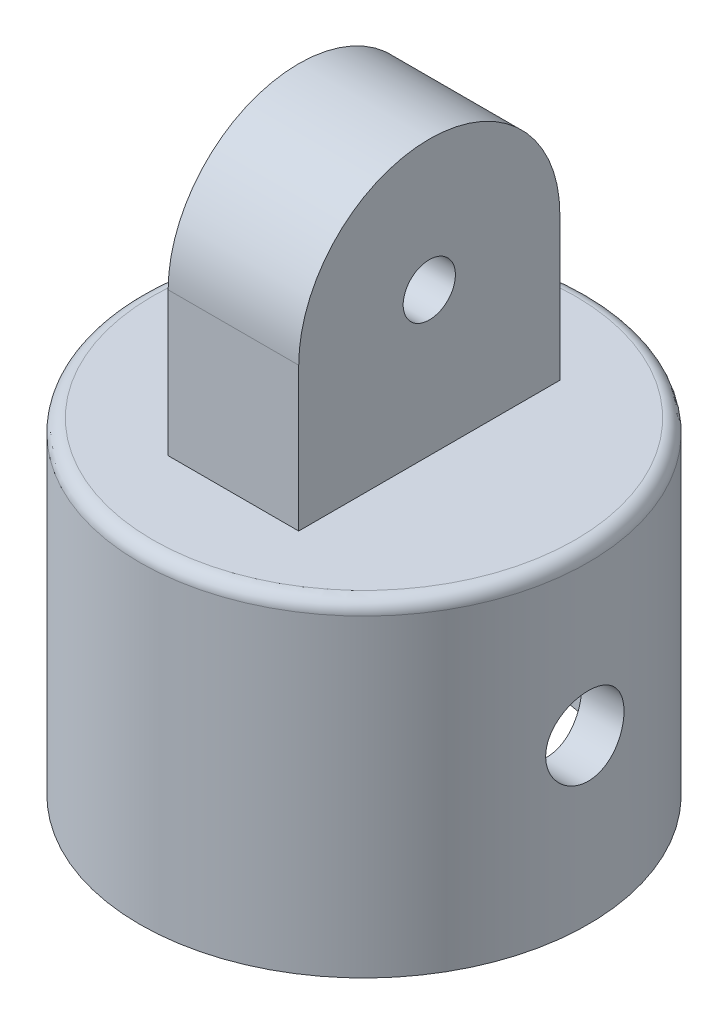
ISO-10303-21;
HEADER;
FILE_DESCRIPTION(('STEP AP214'),'2;1');
FILE_NAME('part.step','',(''),(''),'','','');
FILE_SCHEMA(('AUTOMOTIVE_DESIGN { 1 0 10303 214 1 1 1 1 }'));
ENDSEC;
DATA;
#1=APPLICATION_CONTEXT('core data for automotive mechanical design processes');
#2=APPLICATION_PROTOCOL_DEFINITION('international standard','automotive_design',2000,#1);
#3=PRODUCT_CONTEXT('',#1,'mechanical');
#4=PRODUCT('Part','Part','',(#3));
#5=PRODUCT_RELATED_PRODUCT_CATEGORY('part','',(#4));
#6=PRODUCT_DEFINITION_FORMATION('','',#4);
#7=PRODUCT_DEFINITION_CONTEXT('part definition',#1,'design');
#8=PRODUCT_DEFINITION('design','',#6,#7);
#9=PRODUCT_DEFINITION_SHAPE('','',#8);
#10=(LENGTH_UNIT() NAMED_UNIT(*) SI_UNIT(.MILLI.,.METRE.));
#11=(NAMED_UNIT(*) PLANE_ANGLE_UNIT() SI_UNIT($,.RADIAN.));
#12=(NAMED_UNIT(*) SI_UNIT($,.STERADIAN.) SOLID_ANGLE_UNIT());
#13=UNCERTAINTY_MEASURE_WITH_UNIT(LENGTH_MEASURE(1.E-05),#10,'distance_accuracy_value','');
#14=(GEOMETRIC_REPRESENTATION_CONTEXT(3) GLOBAL_UNCERTAINTY_ASSIGNED_CONTEXT((#13)) GLOBAL_UNIT_ASSIGNED_CONTEXT((#10,
#11,#12)) REPRESENTATION_CONTEXT('',''));
#15=CARTESIAN_POINT('',(0.,0.,0.));
#16=DIRECTION('',(0.,0.,1.));
#17=DIRECTION('',(1.,0.,0.));
#18=AXIS2_PLACEMENT_3D('',#15,#16,#17);
#19=CARTESIAN_POINT('',(0.,25.,0.));
#20=DIRECTION('',(0.,1.,0.));
#21=DIRECTION('',(0.,0.,1.));
#22=AXIS2_PLACEMENT_3D('',#19,#20,#21);
#23=PLANE('',#22);
#24=CARTESIAN_POINT('',(0.,25.,0.));
#25=DIRECTION('',(0.,1.,0.));
#26=DIRECTION('',(0.,0.,1.));
#27=AXIS2_PLACEMENT_3D('',#24,#25,#26);
#28=CIRCLE('',#27,16.175);
#29=CARTESIAN_POINT('',(0.,25.,16.175));
#30=VERTEX_POINT('',#29);
#31=EDGE_CURVE('E45',#30,#30,#28,.T.);
#32=ORIENTED_EDGE('',*,*,#31,.T.);
#33=EDGE_LOOP('',(#32));
#34=FACE_BOUND('',#33,.T.);
#35=DIRECTION('',(0.,0.,-1.));
#36=VECTOR('',#35,1.);
#37=CARTESIAN_POINT('',(5.,25.,0.));
#38=LINE('',#37,#36);
#39=CARTESIAN_POINT('',(5.,25.,10.));
#40=VERTEX_POINT('',#39);
#41=CARTESIAN_POINT('',(5.,25.,-10.));
#42=VERTEX_POINT('',#41);
#43=EDGE_CURVE('E152',#40,#42,#38,.T.);
#44=ORIENTED_EDGE('',*,*,#43,.F.);
#45=DIRECTION('',(-1.,0.,0.));
#46=VECTOR('',#45,1.);
#47=CARTESIAN_POINT('',(0.,25.,10.));
#48=LINE('',#47,#46);
#49=CARTESIAN_POINT('',(-5.,25.,10.));
#50=VERTEX_POINT('',#49);
#51=EDGE_CURVE('E60',#40,#50,#48,.T.);
#52=ORIENTED_EDGE('',*,*,#51,.T.);
#53=DIRECTION('',(0.,0.,-1.));
#54=VECTOR('',#53,1.);
#55=CARTESIAN_POINT('',(-5.,25.,0.));
#56=LINE('',#55,#54);
#57=CARTESIAN_POINT('',(-5.,25.,-10.));
#58=VERTEX_POINT('',#57);
#59=EDGE_CURVE('E148',#50,#58,#56,.T.);
#60=ORIENTED_EDGE('',*,*,#59,.T.);
#61=DIRECTION('',(1.,0.,0.));
#62=VECTOR('',#61,1.);
#63=CARTESIAN_POINT('',(0.,25.,-10.));
#64=LINE('',#63,#62);
#65=EDGE_CURVE('E145',#58,#42,#64,.T.);
#66=ORIENTED_EDGE('',*,*,#65,.T.);
#67=EDGE_LOOP('',(#44,#52,#60,#66));
#68=FACE_BOUND('',#67,.T.);
#69=ADVANCED_FACE('F37',(#34,#68),#23,.T.);
#70=CARTESIAN_POINT('',(0.,25.,0.));
#71=DIRECTION('',(0.,-1.,0.));
#72=DIRECTION('',(0.,0.,-1.));
#73=AXIS2_PLACEMENT_3D('',#70,#71,#72);
#74=CYLINDRICAL_SURFACE('',#73,17.175);
#75=CARTESIAN_POINT('',(0.,24.,0.));
#76=DIRECTION('',(0.,1.,0.));
#77=DIRECTION('',(0.,0.,1.));
#78=AXIS2_PLACEMENT_3D('',#75,#76,#77);
#79=CIRCLE('',#78,17.175);
#80=CARTESIAN_POINT('',(0.,24.,17.175));
#81=VERTEX_POINT('',#80);
#82=EDGE_CURVE('E11',#81,#81,#79,.F.);
#83=ORIENTED_EDGE('',*,*,#82,.T.);
#84=EDGE_LOOP('',(#83));
#85=FACE_BOUND('',#84,.T.);
#86=CARTESIAN_POINT('',(-17.175,9.5,0.));
#87=CARTESIAN_POINT('',(-17.1749970635052,9.50000659187211,-0.167148289489279));
#88=CARTESIAN_POINT('',(-17.1725346177836,9.51401647281769,-0.334384800368738));
#89=CARTESIAN_POINT('',(-17.1629486341287,9.56965780189534,-0.664159130061681));
#90=CARTESIAN_POINT('',(-17.1558209407032,9.61131387587927,-0.826692624838318));
#91=CARTESIAN_POINT('',(-17.1377031338341,9.72094464458748,-1.14224276081582));
#92=CARTESIAN_POINT('',(-17.1267163032768,9.78889697462577,-1.29526736122225));
#93=CARTESIAN_POINT('',(-17.1020851745473,9.94913090339013,-1.58772576854048));
#94=CARTESIAN_POINT('',(-17.0884411471491,10.0414100235033,-1.72716095807158));
#95=CARTESIAN_POINT('',(-17.0598461682079,10.2487038894629,-1.98995828223652));
#96=CARTESIAN_POINT('',(-17.0448841752576,10.3639234350489,-2.11315768711522));
#97=CARTESIAN_POINT('',(-17.0154231251547,10.6133867465183,-2.33857979672025));
#98=CARTESIAN_POINT('',(-17.0009240987208,10.7476317715845,-2.44080111193502));
#99=CARTESIAN_POINT('',(-16.9739235816364,11.0324652249675,-2.62202674431745));
#100=CARTESIAN_POINT('',(-16.9614363483647,11.1831586054149,-2.70086841769337));
#101=CARTESIAN_POINT('',(-16.9400274037381,11.495905269024,-2.83205626116239));
#102=CARTESIAN_POINT('',(-16.9311054270846,11.6579577058787,-2.88440440277363));
#103=CARTESIAN_POINT('',(-16.9179475782782,11.9870912059426,-2.96060290992415));
#104=CARTESIAN_POINT('',(-16.9136653614662,12.1541050869472,-2.98473530704476));
#105=CARTESIAN_POINT('',(-16.9101318739057,12.4898621363561,-3.00469209986036));
#106=CARTESIAN_POINT('',(-16.9108802120575,12.6586051693094,-3.00051869618475));
#107=CARTESIAN_POINT('',(-16.9172810108101,12.9910061934551,-2.96421169390425));
#108=CARTESIAN_POINT('',(-16.9228776493146,13.1547001782352,-2.93239634545114));
#109=CARTESIAN_POINT('',(-16.9382569593342,13.474390653706,-2.84220866801327));
#110=CARTESIAN_POINT('',(-16.9480397872363,13.6303868565815,-2.78383534687561));
#111=CARTESIAN_POINT('',(-16.9707487790121,13.9311983397534,-2.64187032723561));
#112=CARTESIAN_POINT('',(-16.9836911768204,14.0759506160922,-2.55814783258912));
#113=CARTESIAN_POINT('',(-17.0112499621668,14.3494724281278,-2.3679537669558));
#114=CARTESIAN_POINT('',(-17.0258664977133,14.4782405485844,-2.26148018385122));
#115=CARTESIAN_POINT('',(-17.0553711743625,14.7179797338008,-2.02707906331825));
#116=CARTESIAN_POINT('',(-17.0702603012824,14.8286841763528,-1.89887877895758));
#117=CARTESIAN_POINT('',(-17.0984487009776,15.027052108912,-1.62558219088861));
#118=CARTESIAN_POINT('',(-17.1117479615503,15.1147154220809,-1.48048575751645));
#119=CARTESIAN_POINT('',(-17.1352798688426,15.264542451419,-1.17725477739282));
#120=CARTESIAN_POINT('',(-17.1455094943506,15.3266810675832,-1.01910757962066));
#121=CARTESIAN_POINT('',(-17.1617256495258,15.4234392102041,-0.694402499751714));
#122=CARTESIAN_POINT('',(-17.1677125695406,15.458061268342,-0.527845392914766));
#123=CARTESIAN_POINT('',(-17.1747158434113,15.4984384811538,-0.193344907664775));
#124=CARTESIAN_POINT('',(-17.1757951716153,15.5045593880773,-0.0254469524642002));
#125=CARTESIAN_POINT('',(-17.1730346789395,15.4887378765646,0.308974548671828));
#126=CARTESIAN_POINT('',(-17.1691950666511,15.4667966481246,0.475498152586318));
#127=CARTESIAN_POINT('',(-17.1570671809606,15.3957778850986,0.801302943557366));
#128=CARTESIAN_POINT('',(-17.1488088469861,15.3468829112129,0.960625136164098));
#129=CARTESIAN_POINT('',(-17.1287656717313,15.223540311392,1.2688109184486));
#130=CARTESIAN_POINT('',(-17.1169806165634,15.1490911356122,1.41767387312109));
#131=CARTESIAN_POINT('',(-17.0910345716264,14.975926259707,1.70229395561455));
#132=CARTESIAN_POINT('',(-17.0768518092164,14.8769839333216,1.83791117848541));
#133=CARTESIAN_POINT('',(-17.0477454304149,14.6579512098598,2.09074803908737));
#134=CARTESIAN_POINT('',(-17.0328217546295,14.5378591153785,2.20796619874628));
#135=CARTESIAN_POINT('',(-17.0037099310466,14.278289539754,2.42204600586923));
#136=CARTESIAN_POINT('',(-16.9895321436978,14.138606116474,2.51865958610338));
#137=CARTESIAN_POINT('',(-16.9637162708469,13.8447775118953,2.68705094428561));
#138=CARTESIAN_POINT('',(-16.9520780993174,13.690632820713,2.75882956354568));
#139=CARTESIAN_POINT('',(-16.9327382512476,13.3729271733318,2.87514955803787));
#140=CARTESIAN_POINT('',(-16.9250192797085,13.2094111946521,2.91981077354952));
#141=CARTESIAN_POINT('',(-16.9143498078558,12.8770510328357,2.98100271523357));
#142=CARTESIAN_POINT('',(-16.9113988478569,12.7082073649434,2.99753615322143));
#143=CARTESIAN_POINT('',(-16.9106206478166,12.3724645111295,3.00192193428798));
#144=CARTESIAN_POINT('',(-16.9127236017402,12.2055704639702,2.99016502846423));
#145=CARTESIAN_POINT('',(-16.9216626242146,11.8761750903346,2.93915270403888));
#146=CARTESIAN_POINT('',(-16.9284986729106,11.7136737454344,2.89989740079008));
#147=CARTESIAN_POINT('',(-16.9461060307579,11.3978496719317,2.79515801956038));
#148=CARTESIAN_POINT('',(-16.9568718055419,11.2445143861714,2.72971081609416));
#149=CARTESIAN_POINT('',(-16.9811303642995,10.95093729936,2.57448646081305));
#150=CARTESIAN_POINT('',(-16.9946233051323,10.8106962521326,2.4847079094235));
#151=CARTESIAN_POINT('',(-17.0230354940364,10.5453205092101,2.28198809707014));
#152=CARTESIAN_POINT('',(-17.0379710253367,10.4204062725833,2.16876047619869));
#153=CARTESIAN_POINT('',(-17.067458706083,10.1912184950816,1.92295833387837));
#154=CARTESIAN_POINT('',(-17.082010766475,10.0869497127433,1.79037936437327));
#155=CARTESIAN_POINT('',(-17.1092217915965,9.90127568070745,1.50842603254887));
#156=CARTESIAN_POINT('',(-17.1218653924572,9.82005178664257,1.35893073454188));
#157=CARTESIAN_POINT('',(-17.1436853894143,9.68399786129939,1.0482522273996));
#158=CARTESIAN_POINT('',(-17.1528651644407,9.6291420937722,0.887080592369371));
#159=CARTESIAN_POINT('',(-17.1647684386511,9.55900518072146,0.604447490662792));
#160=CARTESIAN_POINT('',(-17.1685843403967,9.53691454338781,0.484675630115192));
#161=CARTESIAN_POINT('',(-17.1737011645946,9.50740970100603,0.243284735642671));
#162=CARTESIAN_POINT('',(-17.1750021374482,9.49999520183549,0.121665738785172));
#163=CARTESIAN_POINT('',(-17.175,9.5,0.));
#164=B_SPLINE_CURVE_WITH_KNOTS('',3,(#86,#87,#88,#89,#90,#91,#92,#93,#94,#95,#96,#97,#98,#99,
#100,#101,#102,#103,#104,#105,#106,#107,#108,#109,#110,#111,#112,#113,#114,#115,#116,#117,#118,
#119,#120,#121,#122,#123,#124,#125,#126,#127,#128,#129,#130,#131,#132,#133,#134,#135,#136,#137,
#138,#139,#140,#141,#142,#143,#144,#145,#146,#147,#148,#149,#150,#151,#152,#153,#154,#155,#156,
#157,#158,#159,#160,#161,#162,#163),.UNSPECIFIED.,.T.,.F.,(4,2,2,2,2,2,2,2,2,2,2,2,2,2,2,2,2,2,
2,2,2,2,2,2,2,2,2,2,2,2,2,2,2,2,2,2,2,2,4),(0.,0.501000066437476,1.00244699881175,
1.50346838988534,2.00443875250745,2.51010007732385,3.01579488448559,3.52492926900674,
4.03402576068198,4.53798883619437,5.04191273163709,5.54011054710815,6.03832697578471,
6.53915921439406,7.04003576520604,7.54774222983647,8.055452590948,8.56366102653766,
9.07182269862152,9.57344487686842,10.0750457841498,10.5732903082599,11.0715650558912,
11.5746347810325,12.0777448991671,12.5866072768891,13.0954524146425,13.6020321213631,
14.1085629856701,14.6081378096685,15.1077105380169,15.606582398579,16.1054829610717,
16.6108792262553,17.1163918441329,17.6257788159822,18.1346675929965,18.4993483505383,
18.8640217994906),.UNSPECIFIED.);
#165=CARTESIAN_POINT('',(-17.175,9.5,0.));
#166=VERTEX_POINT('',#165);
#167=EDGE_CURVE('E113',#166,#166,#164,.T.);
#168=ORIENTED_EDGE('',*,*,#167,.T.);
#169=EDGE_LOOP('',(#168));
#170=FACE_BOUND('',#169,.T.);
#171=CARTESIAN_POINT('',(16.9109616817022,12.5,-3.));
#172=CARTESIAN_POINT('',(16.9109647913376,12.332873637246,-2.99999339013559));
#173=CARTESIAN_POINT('',(16.9134660473036,12.1656590005569,-2.9859870604747));
#174=CARTESIAN_POINT('',(16.9231904689292,11.8359301012465,-2.9303611162025));
#175=CARTESIAN_POINT('',(16.9304178595155,11.6734201802731,-2.88871679412004));
#176=CARTESIAN_POINT('',(16.9487515769502,11.3579199450822,-2.77912038868063));
#177=CARTESIAN_POINT('',(16.959854523746,11.2049214720295,-2.71119122397177));
#178=CARTESIAN_POINT('',(16.9846843365821,10.9125070319998,-2.55101188588846));
#179=CARTESIAN_POINT('',(16.9984109410671,10.773089713192,-2.45876413651376));
#180=CARTESIAN_POINT('',(17.0271072860652,10.5102729942818,-2.25150228897949));
#181=CARTESIAN_POINT('',(17.0420877786174,10.3870418013502,-2.13627635554347));
#182=CARTESIAN_POINT('',(17.0715086707297,10.1615581158525,-1.88678681859762));
#183=CARTESIAN_POINT('',(17.0859490369867,10.0593069151305,-1.75252204363051));
#184=CARTESIAN_POINT('',(17.1127769682926,9.87804939847534,-1.46767050891587));
#185=CARTESIAN_POINT('',(17.1251504054511,9.79920040883237,-1.3169821945645));
#186=CARTESIAN_POINT('',(17.1463304103324,9.66799765211117,-1.00424651108797));
#187=CARTESIAN_POINT('',(17.1551372326046,9.61564199413577,-0.84219995356997));
#188=CARTESIAN_POINT('',(17.1681157975394,9.53942870950504,-0.513087644709646));
#189=CARTESIAN_POINT('',(17.1723335391822,9.5152880821777,-0.346089272188525));
#190=CARTESIAN_POINT('',(17.1758169482093,9.49530945151501,-0.0103628244628817));
#191=CARTESIAN_POINT('',(17.1750829837833,9.49946934386272,0.158365121205772));
#192=CARTESIAN_POINT('',(17.168781918279,9.53575432433687,0.490824036666636));
#193=CARTESIAN_POINT('',(17.1632674655701,9.56757479201192,0.654589394185489));
#194=CARTESIAN_POINT('',(17.1480838423594,9.65779720508036,0.974419945331944));
#195=CARTESIAN_POINT('',(17.1384145357717,9.71620002114152,1.13048488655755));
#196=CARTESIAN_POINT('',(17.115918595028,9.8582273700751,1.43138212205215));
#197=CARTESIAN_POINT('',(17.1030764809756,9.94197602815822,1.57615462310757));
#198=CARTESIAN_POINT('',(17.0756592996357,10.1322266203138,1.84970591880123));
#199=CARTESIAN_POINT('',(17.0610840787271,10.238730572062,1.97848329357472));
#200=CARTESIAN_POINT('',(17.0315900894273,10.4731540541142,2.21819055470915));
#201=CARTESIAN_POINT('',(17.0166693309355,10.6013399359537,2.32885987344869));
#202=CARTESIAN_POINT('',(16.988352874681,10.8745949135443,2.52716368652488));
#203=CARTESIAN_POINT('',(16.974957193806,11.0196641962163,2.6147979257988));
#204=CARTESIAN_POINT('',(16.9512058457777,11.3228861726497,2.76460366713648));
#205=CARTESIAN_POINT('',(16.940854215749,11.4810558877342,2.826741397623));
#206=CARTESIAN_POINT('',(16.9244278299057,11.8058101489868,2.92349094769237));
#207=CARTESIAN_POINT('',(16.9183526579099,11.972393874619,2.95810544585527));
#208=CARTESIAN_POINT('',(16.9112482701092,12.3069092968287,2.99845404557244));
#209=CARTESIAN_POINT('',(16.9101539726438,12.4747947216053,3.00456066717762));
#210=CARTESIAN_POINT('',(16.9129615867985,12.809187796133,2.98871505898387));
#211=CARTESIAN_POINT('',(16.9168632855497,12.9756955042815,2.96676402466303));
#212=CARTESIAN_POINT('',(16.9291629562577,13.3014079941883,2.89574465118159));
#213=CARTESIAN_POINT('',(16.9375291275207,13.4606558855417,2.84686802589495));
#214=CARTESIAN_POINT('',(16.9577881407255,13.7687011257263,2.72358683137779));
#215=CARTESIAN_POINT('',(16.9696812120987,13.9174977939068,2.64918060134963));
#216=CARTESIAN_POINT('',(16.9958040823137,14.202068504816,2.47608123690537));
#217=CARTESIAN_POINT('',(17.0100562464217,14.3376960120342,2.37715063911283));
#218=CARTESIAN_POINT('',(17.0392269725185,14.5905590351304,2.15813460936459));
#219=CARTESIAN_POINT('',(17.0541455861187,14.7077931233953,2.03804753687423));
#220=CARTESIAN_POINT('',(17.0831753451256,14.9219134010532,1.77847196406111));
#221=CARTESIAN_POINT('',(17.0972752459255,15.0185503711124,1.63877643516675));
#222=CARTESIAN_POINT('',(17.1228953366057,15.1869827127351,1.34491679859698));
#223=CARTESIAN_POINT('',(17.1344156160993,15.2587789472877,1.1907531937919));
#224=CARTESIAN_POINT('',(17.1535297592583,15.375109403661,0.873054625337926));
#225=CARTESIAN_POINT('',(17.1611419487938,15.4197710497435,0.709567470398412));
#226=CARTESIAN_POINT('',(17.1716599669864,15.4809735967883,0.377268587830866));
#227=CARTESIAN_POINT('',(17.1745662227179,15.4975170495482,0.208457344793764));
#228=CARTESIAN_POINT('',(17.1753379699681,15.5019344376074,-0.127298170002415));
#229=CARTESIAN_POINT('',(17.1732699476744,15.4901865128768,-0.294237433586659));
#230=CARTESIAN_POINT('',(17.1644621244481,15.439176341245,-0.623725607157988));
#231=CARTESIAN_POINT('',(17.1577223561877,15.3999142867662,-0.786274547840916));
#232=CARTESIAN_POINT('',(17.1403264689128,15.2951408723118,-1.10220282165255));
#233=CARTESIAN_POINT('',(17.1296756003481,15.2296646928521,-1.25559412895426));
#234=CARTESIAN_POINT('',(17.1056165660197,15.0743648795257,-1.54927133945047));
#235=CARTESIAN_POINT('',(17.0922082490608,14.9845399104895,-1.68955652340127));
#236=CARTESIAN_POINT('',(17.0639064596208,14.7817660893504,-1.95493678018361));
#237=CARTESIAN_POINT('',(17.0489964865861,14.668541658029,-2.0798195501813));
#238=CARTESIAN_POINT('',(17.0194822427417,14.4227592248074,-2.30894532011218));
#239=CARTESIAN_POINT('',(17.004878044398,14.2901966979482,-2.41318347587564));
#240=CARTESIAN_POINT('',(16.9775043415702,14.0082595324615,-2.59882094741004));
#241=CARTESIAN_POINT('',(16.9647501623204,13.8587609238927,-2.68003428284642));
#242=CARTESIAN_POINT('',(16.9427027685316,13.5480760934511,-2.81606757729606));
#243=CARTESIAN_POINT('',(16.9334061687136,13.386901489181,-2.8709133679717));
#244=CARTESIAN_POINT('',(16.9213429419486,13.1042943851081,-2.94102489719931));
#245=CARTESIAN_POINT('',(16.9174721531613,12.9845532008565,-2.96310419623825));
#246=CARTESIAN_POINT('',(16.9122804185297,12.7432235710392,-2.99259399711576));
#247=CARTESIAN_POINT('',(16.9109594184984,12.6216351647852,-3.00000481068297));
#248=CARTESIAN_POINT('',(16.9109616817022,12.5,-3.));
#249=B_SPLINE_CURVE_WITH_KNOTS('',3,(#171,#172,#173,#174,#175,#176,#177,#178,#179,#180,#181,
#182,#183,#184,#185,#186,#187,#188,#189,#190,#191,#192,#193,#194,#195,#196,#197,#198,#199,#200,
#201,#202,#203,#204,#205,#206,#207,#208,#209,#210,#211,#212,#213,#214,#215,#216,#217,#218,#219,
#220,#221,#222,#223,#224,#225,#226,#227,#228,#229,#230,#231,#232,#233,#234,#235,#236,#237,#238,
#239,#240,#241,#242,#243,#244,#245,#246,#247,#248),.UNSPECIFIED.,.T.,.F.,(4,2,2,2,2,2,2,2,2,2,2,
2,2,2,2,2,2,2,2,2,2,2,2,2,2,2,2,2,2,2,2,2,2,2,2,2,2,2,4),(0.,0.500934172760822,1.00231676877236,
1.50326317380056,2.00415966493992,2.5099072420403,3.01568595123279,3.52479161148077,
4.03386093042255,4.53777916233192,5.04165992524419,5.54006085958786,6.03847811953435,
6.53937687996212,7.04032007273519,7.54793561894886,8.0555567856488,8.56384817172662,
9.07209008447787,9.57367171983823,10.0752319845657,10.5732663833901,11.0713331873862,
11.574425128435,12.0775560978825,12.5864668350835,13.0953598904999,13.6018443266812,
14.1082827956589,14.6079899070335,15.1076935236985,15.6067287520094,16.1057913505316,
16.6111057584429,17.1165385960886,17.6259446987382,18.1348507260995,18.4994401575494,
18.8640218408112),.UNSPECIFIED.);
#250=CARTESIAN_POINT('',(16.9109616817022,12.5,-3.));
#251=VERTEX_POINT('',#250);
#252=EDGE_CURVE('E106',#251,#251,#249,.T.);
#253=ORIENTED_EDGE('',*,*,#252,.T.);
#254=EDGE_LOOP('',(#253));
#255=FACE_BOUND('',#254,.T.);
#256=CARTESIAN_POINT('',(0.,0.,0.));
#257=DIRECTION('',(0.,1.,0.));
#258=DIRECTION('',(0.,0.,1.));
#259=AXIS2_PLACEMENT_3D('',#256,#257,#258);
#260=CIRCLE('',#259,17.175);
#261=CARTESIAN_POINT('',(0.,0.,17.175));
#262=VERTEX_POINT('',#261);
#263=EDGE_CURVE('E149',#262,#262,#260,.T.);
#264=ORIENTED_EDGE('',*,*,#263,.T.);
#265=EDGE_LOOP('',(#264));
#266=FACE_BOUND('',#265,.T.);
#267=ADVANCED_FACE('F118',(#85,#170,#255,#266),#74,.T.);
#268=CARTESIAN_POINT('',(0.,0.,0.));
#269=DIRECTION('',(0.,1.,0.));
#270=DIRECTION('',(0.,0.,1.));
#271=AXIS2_PLACEMENT_3D('',#268,#269,#270);
#272=PLANE('',#271);
#273=CARTESIAN_POINT('',(0.,0.,0.));
#274=DIRECTION('',(0.,1.,0.));
#275=DIRECTION('',(0.,0.,1.));
#276=AXIS2_PLACEMENT_3D('',#273,#274,#275);
#277=CIRCLE('',#276,14.);
#278=CARTESIAN_POINT('',(0.,0.,14.));
#279=VERTEX_POINT('',#278);
#280=EDGE_CURVE('E186',#279,#279,#277,.T.);
#281=ORIENTED_EDGE('',*,*,#280,.T.);
#282=EDGE_LOOP('',(#281));
#283=FACE_BOUND('',#282,.T.);
#284=ORIENTED_EDGE('',*,*,#263,.F.);
#285=EDGE_LOOP('',(#284));
#286=FACE_BOUND('',#285,.T.);
#287=ADVANCED_FACE('F174',(#283,#286),#272,.F.);
#288=CARTESIAN_POINT('',(0.,25.,0.));
#289=DIRECTION('',(0.,-1.,0.));
#290=DIRECTION('',(0.,0.,-1.));
#291=AXIS2_PLACEMENT_3D('',#288,#289,#290);
#292=CYLINDRICAL_SURFACE('',#291,14.);
#293=CARTESIAN_POINT('',(-13.6747943311773,12.5,-3.));
#294=CARTESIAN_POINT('',(-13.6747976912119,12.666422304966,-2.99999416477353));
#295=CARTESIAN_POINT('',(-13.6778654468474,12.8329155478848,-2.9861047248957));
#296=CARTESIAN_POINT('',(-13.6897835685885,13.1611733444834,-2.93097118505965));
#297=CARTESIAN_POINT('',(-13.6986382242345,13.3229342973523,-2.88970679307235));
#298=CARTESIAN_POINT('',(-13.7210823058705,13.6369314991486,-2.78117727369208));
#299=CARTESIAN_POINT('',(-13.7346666545171,13.789177756243,-2.71394001982631));
#300=CARTESIAN_POINT('',(-13.7650334169723,14.0802305478892,-2.55545235346679));
#301=CARTESIAN_POINT('',(-13.7818157375507,14.2190374740581,-2.46420264097551));
#302=CARTESIAN_POINT('',(-13.8169915759332,14.4815259229643,-2.25870285140442));
#303=CARTESIAN_POINT('',(-13.8354049974351,14.6049577524799,-2.14413718967966));
#304=CARTESIAN_POINT('',(-13.8715938342079,14.8310071088116,-1.89593901625915));
#305=CARTESIAN_POINT('',(-13.8893692010283,14.9336230577201,-1.76230506043535));
#306=CARTESIAN_POINT('',(-13.9224953821886,15.1161108889829,-1.47809457692916));
#307=CARTESIAN_POINT('',(-13.9378199763886,15.1957433115412,-1.3273609764599));
#308=CARTESIAN_POINT('',(-13.9640934208587,15.3284553828926,-1.01426853868519));
#309=CARTESIAN_POINT('',(-13.9750427420666,15.3815378895726,-0.851910954760623));
#310=CARTESIAN_POINT('',(-13.9911913056236,15.4588599418627,-0.522774375343023));
#311=CARTESIAN_POINT('',(-13.9964746675677,15.4835218571049,-0.356098801193846));
#312=CARTESIAN_POINT('',(-14.00098724414,15.5046225546265,-0.0208978906132882));
#313=CARTESIAN_POINT('',(-14.000217124654,15.5010644411215,0.14762724032952));
#314=CARTESIAN_POINT('',(-13.9927740172512,15.4661420706728,0.478834058501025));
#315=CARTESIAN_POINT('',(-13.9861976630486,15.4352329994202,0.641566230724226));
#316=CARTESIAN_POINT('',(-13.9679908317821,15.3472106362963,0.959478927956778));
#317=CARTESIAN_POINT('',(-13.9563601323304,15.2900961914005,1.11465912035011));
#318=CARTESIAN_POINT('',(-13.9291950929372,15.150877082223,1.41433499511311));
#319=CARTESIAN_POINT('',(-13.9136337160789,15.0685984655913,1.55874731403158));
#320=CARTESIAN_POINT('',(-13.8803158748773,14.8815160636728,1.83188185312569));
#321=CARTESIAN_POINT('',(-13.8625591228939,14.7767093253994,1.96060201290306));
#322=CARTESIAN_POINT('',(-13.8263865292185,14.5450629109443,2.20140417600396));
#323=CARTESIAN_POINT('',(-13.8079646074571,14.4178248412859,2.31310234640501));
#324=CARTESIAN_POINT('',(-13.7728713366395,14.146233429863,2.51364486469456));
#325=CARTESIAN_POINT('',(-13.7562000312677,14.0018796611895,2.60248864236137));
#326=CARTESIAN_POINT('',(-13.7264804717345,13.6995509978725,2.75496155146593));
#327=CARTESIAN_POINT('',(-13.7134423025555,13.5415397522951,2.81852070177845));
#328=CARTESIAN_POINT('',(-13.6926068161323,13.2167344681071,2.91806990318231));
#329=CARTESIAN_POINT('',(-13.6848087043697,13.0499417651136,2.95406413389256));
#330=CARTESIAN_POINT('',(-13.6754976251089,12.7158084947006,2.99687172049304));
#331=CARTESIAN_POINT('',(-13.673864541034,12.5485426498454,3.0042428385728));
#332=CARTESIAN_POINT('',(-13.6767447914799,12.2151720136366,2.99110279284747));
#333=CARTESIAN_POINT('',(-13.6812577220213,12.0490671466929,2.9705934616327));
#334=CARTESIAN_POINT('',(-13.6958083096841,11.7246591300385,2.90275789271168));
#335=CARTESIAN_POINT('',(-13.7057831054873,11.5662891348061,2.85573660503107));
#336=CARTESIAN_POINT('',(-13.7300771973955,11.2596753249342,2.73654105893499));
#337=CARTESIAN_POINT('',(-13.744396895457,11.1114324487316,2.66436447325636));
#338=CARTESIAN_POINT('',(-13.7760326816069,10.8268606304822,2.4956700883341));
#339=CARTESIAN_POINT('',(-13.7933900349263,10.6907408359756,2.39880737181584));
#340=CARTESIAN_POINT('',(-13.8290355072028,10.4364833082524,2.18394367667201));
#341=CARTESIAN_POINT('',(-13.8473237366892,10.3183477171031,2.06594018364322));
#342=CARTESIAN_POINT('',(-13.8831647998035,10.1012593941105,1.80962552884163));
#343=CARTESIAN_POINT('',(-13.9006987121549,10.002686167686,1.67098985165754));
#344=CARTESIAN_POINT('',(-13.932712214298,9.8302291812979,1.37880296256455));
#345=CARTESIAN_POINT('',(-13.9471919435339,9.75634429405434,1.22525243208748));
#346=CARTESIAN_POINT('',(-13.9713855676315,9.63589589072304,0.90853083796408));
#347=CARTESIAN_POINT('',(-13.9811288760739,9.58916339250744,0.745426386150346));
#348=CARTESIAN_POINT('',(-13.9948787860397,9.52381658853537,0.413450354006575));
#349=CARTESIAN_POINT('',(-13.9988861862461,9.50519836805219,0.244579579947977));
#350=CARTESIAN_POINT('',(-14.000690220181,9.49677869517627,-0.0905274341056523));
#351=CARTESIAN_POINT('',(-13.9986091800327,9.50640968279071,-0.256749011018432));
#352=CARTESIAN_POINT('',(-13.9887310472683,9.55294952703811,-0.585145876831952));
#353=CARTESIAN_POINT('',(-13.9809340494761,9.58985793115682,-0.747321232810678));
#354=CARTESIAN_POINT('',(-13.9605077727683,9.6896376124988,-1.06260389697444));
#355=CARTESIAN_POINT('',(-13.9478929286009,9.75243137877043,-1.21573673014596));
#356=CARTESIAN_POINT('',(-13.9191807210221,9.90212254233893,-1.50936991344684));
#357=CARTESIAN_POINT('',(-13.9030830344402,9.98902217661461,-1.64986908959375));
#358=CARTESIAN_POINT('',(-13.8687961986559,10.1863246374828,-1.917024613789));
#359=CARTESIAN_POINT('',(-13.8505741780296,10.2971283166328,-2.04338073020593));
#360=CARTESIAN_POINT('',(-13.8142738016446,10.5382812205105,-2.27590002915847));
#361=CARTESIAN_POINT('',(-13.7961954813912,10.6686351267478,-2.38205836126942));
#362=CARTESIAN_POINT('',(-13.761973872554,10.9471809863392,-2.57246523191562));
#363=CARTESIAN_POINT('',(-13.7458581173137,11.0955787164455,-2.65641795611844));
#364=CARTESIAN_POINT('',(-13.7177299427787,11.4046874417168,-2.79806009312271));
#365=CARTESIAN_POINT('',(-13.7057139912142,11.5653876904719,-2.8557721284606));
#366=CARTESIAN_POINT('',(-13.6894112131582,11.8552522623923,-2.93277214244341));
#367=CARTESIAN_POINT('',(-13.683965661845,11.9828233514212,-2.95793505015818));
#368=CARTESIAN_POINT('',(-13.6766559900021,12.2402486231491,-2.99155088086543));
#369=CARTESIAN_POINT('',(-13.6747917085757,12.370102703015,-3.00000455455863));
#370=CARTESIAN_POINT('',(-13.6747943311773,12.5,-3.));
#371=B_SPLINE_CURVE_WITH_KNOTS('',3,(#293,#294,#295,#296,#297,#298,#299,#300,#301,#302,#303,
#304,#305,#306,#307,#308,#309,#310,#311,#312,#313,#314,#315,#316,#317,#318,#319,#320,#321,#322,
#323,#324,#325,#326,#327,#328,#329,#330,#331,#332,#333,#334,#335,#336,#337,#338,#339,#340,#341,
#342,#343,#344,#345,#346,#347,#348,#349,#350,#351,#352,#353,#354,#355,#356,#357,#358,#359,#360,
#361,#362,#363,#364,#365,#366,#367,#368,#369,#370),.UNSPECIFIED.,.T.,.F.,(4,2,2,2,2,2,2,2,2,2,2,
2,2,2,2,2,2,2,2,2,2,2,2,2,2,2,2,2,2,2,2,2,2,2,2,2,2,2,4),(0.,0.498790964055055,
0.997952076959928,1.49657898230552,1.99519135347057,2.50106459165384,3.00697616225757,
3.51798269640557,4.02893421292535,4.53219016303857,5.03539075554482,5.53037115334743,
6.02537333215168,6.52387776286874,7.0224475774463,7.5309792155859,8.03952354046184,
8.54946574823562,9.05933061907677,9.55920866385046,10.0590538530783,10.5532636149875,
11.047519111263,11.5491002043264,12.0507409931816,12.5613242936642,13.0718842775108,
13.5792317964875,14.0865086641708,14.5836639928825,15.080811074302,15.5764801923897,
16.0721953230273,16.5769782832193,17.0818823126247,17.593207603363,18.1040912322742,
18.4934291224859,18.8827495204009),.UNSPECIFIED.);
#372=CARTESIAN_POINT('',(-13.6747943311773,12.5,-3.));
#373=VERTEX_POINT('',#372);
#374=EDGE_CURVE('E101',#373,#373,#371,.T.);
#375=ORIENTED_EDGE('',*,*,#374,.F.);
#376=EDGE_LOOP('',(#375));
#377=FACE_BOUND('',#376,.T.);
#378=CARTESIAN_POINT('',(13.6747943311773,12.5,-3.));
#379=CARTESIAN_POINT('',(13.6747976912119,12.333577695034,-2.99999416477353));
#380=CARTESIAN_POINT('',(13.6778654468474,12.1670844521152,-2.9861047248957));
#381=CARTESIAN_POINT('',(13.6897835685885,11.8388266555166,-2.93097118505965));
#382=CARTESIAN_POINT('',(13.6986382242345,11.6770657026477,-2.88970679307235));
#383=CARTESIAN_POINT('',(13.7210823058705,11.3630685008514,-2.78117727369208));
#384=CARTESIAN_POINT('',(13.7346666545171,11.210822243757,-2.71394001982631));
#385=CARTESIAN_POINT('',(13.7650334169723,10.9197694521108,-2.55545235346679));
#386=CARTESIAN_POINT('',(13.7818157375507,10.7809625259419,-2.46420264097551));
#387=CARTESIAN_POINT('',(13.8169915759332,10.5184740770357,-2.25870285140442));
#388=CARTESIAN_POINT('',(13.8354049974351,10.3950422475201,-2.14413718967966));
#389=CARTESIAN_POINT('',(13.8715938342079,10.1689928911884,-1.89593901625915));
#390=CARTESIAN_POINT('',(13.8893692010283,10.0663769422799,-1.76230506043535));
#391=CARTESIAN_POINT('',(13.9224953821886,9.88388911101713,-1.47809457692916));
#392=CARTESIAN_POINT('',(13.9378199763886,9.80425668845876,-1.32736097645991));
#393=CARTESIAN_POINT('',(13.9640934208587,9.67154461710742,-1.01426853868519));
#394=CARTESIAN_POINT('',(13.9750427420666,9.61846211042744,-0.851910954760623));
#395=CARTESIAN_POINT('',(13.9911913056236,9.54114005813732,-0.522774375343023));
#396=CARTESIAN_POINT('',(13.9964746675677,9.51647814289514,-0.356098801193846));
#397=CARTESIAN_POINT('',(14.00098724414,9.49537744537349,-0.0208978906132882));
#398=CARTESIAN_POINT('',(14.000217124654,9.49893555887849,0.14762724032952));
#399=CARTESIAN_POINT('',(13.9927740172512,9.53385792932717,0.478834058501025));
#400=CARTESIAN_POINT('',(13.9861976630486,9.56476700057985,0.641566230724226));
#401=CARTESIAN_POINT('',(13.9679908317821,9.65278936370373,0.959478927956778));
#402=CARTESIAN_POINT('',(13.9563601323304,9.70990380859948,1.11465912035011));
#403=CARTESIAN_POINT('',(13.9291950929372,9.84912291777704,1.41433499511311));
#404=CARTESIAN_POINT('',(13.9136337160789,9.9314015344087,1.55874731403158));
#405=CARTESIAN_POINT('',(13.8803158748773,10.1184839363272,1.83188185312569));
#406=CARTESIAN_POINT('',(13.8625591228939,10.2232906746006,1.96060201290306));
#407=CARTESIAN_POINT('',(13.8263865292185,10.4549370890557,2.20140417600396));
#408=CARTESIAN_POINT('',(13.8079646074571,10.5821751587141,2.31310234640501));
#409=CARTESIAN_POINT('',(13.7728713366395,10.853766570137,2.51364486469456));
#410=CARTESIAN_POINT('',(13.7562000312677,10.9981203388105,2.60248864236137));
#411=CARTESIAN_POINT('',(13.7264804717345,11.3004490021275,2.75496155146593));
#412=CARTESIAN_POINT('',(13.7134423025555,11.4584602477049,2.81852070177845));
#413=CARTESIAN_POINT('',(13.6926068161323,11.7832655318929,2.91806990318231));
#414=CARTESIAN_POINT('',(13.6848087043697,11.9500582348864,2.95406413389256));
#415=CARTESIAN_POINT('',(13.6754976251089,12.2841915052994,2.99687172049304));
#416=CARTESIAN_POINT('',(13.673864541034,12.4514573501546,3.0042428385728));
#417=CARTESIAN_POINT('',(13.6767447914799,12.7848279863634,2.99110279284747));
#418=CARTESIAN_POINT('',(13.6812577220213,12.9509328533071,2.9705934616327));
#419=CARTESIAN_POINT('',(13.6958083096841,13.2753408699615,2.90275789271168));
#420=CARTESIAN_POINT('',(13.7057831054873,13.4337108651939,2.85573660503107));
#421=CARTESIAN_POINT('',(13.7300771973955,13.7403246750658,2.73654105893499));
#422=CARTESIAN_POINT('',(13.744396895457,13.8885675512684,2.66436447325636));
#423=CARTESIAN_POINT('',(13.7760326816069,14.1731393695178,2.4956700883341));
#424=CARTESIAN_POINT('',(13.7933900349263,14.3092591640244,2.39880737181584));
#425=CARTESIAN_POINT('',(13.8290355072028,14.5635166917476,2.18394367667201));
#426=CARTESIAN_POINT('',(13.8473237366892,14.6816522828969,2.06594018364322));
#427=CARTESIAN_POINT('',(13.8831647998035,14.8987406058895,1.80962552884163));
#428=CARTESIAN_POINT('',(13.9006987121549,14.997313832314,1.67098985165754));
#429=CARTESIAN_POINT('',(13.932712214298,15.1697708187021,1.37880296256455));
#430=CARTESIAN_POINT('',(13.9471919435339,15.2436557059457,1.22525243208748));
#431=CARTESIAN_POINT('',(13.9713855676315,15.364104109277,0.90853083796408));
#432=CARTESIAN_POINT('',(13.9811288760739,15.4108366074926,0.745426386150346));
#433=CARTESIAN_POINT('',(13.9948787860397,15.4761834114646,0.413450354006575));
#434=CARTESIAN_POINT('',(13.9988861862461,15.4948016319478,0.244579579947977));
#435=CARTESIAN_POINT('',(14.000690220181,15.5032213048237,-0.0905274341056523));
#436=CARTESIAN_POINT('',(13.9986091800327,15.4935903172093,-0.256749011018432));
#437=CARTESIAN_POINT('',(13.9887310472683,15.4470504729619,-0.585145876831952));
#438=CARTESIAN_POINT('',(13.9809340494761,15.4101420688432,-0.747321232810678));
#439=CARTESIAN_POINT('',(13.9605077727683,15.3103623875012,-1.06260389697444));
#440=CARTESIAN_POINT('',(13.9478929286009,15.2475686212296,-1.21573673014596));
#441=CARTESIAN_POINT('',(13.9191807210221,15.0978774576611,-1.50936991344684));
#442=CARTESIAN_POINT('',(13.9030830344402,15.0109778233854,-1.64986908959375));
#443=CARTESIAN_POINT('',(13.8687961986559,14.8136753625173,-1.917024613789));
#444=CARTESIAN_POINT('',(13.8505741780296,14.7028716833672,-2.04338073020593));
#445=CARTESIAN_POINT('',(13.8142738016446,14.4617187794895,-2.27590002915847));
#446=CARTESIAN_POINT('',(13.7961954813912,14.3313648732522,-2.38205836126942));
#447=CARTESIAN_POINT('',(13.761973872554,14.0528190136608,-2.57246523191562));
#448=CARTESIAN_POINT('',(13.7458581173137,13.9044212835546,-2.65641795611844));
#449=CARTESIAN_POINT('',(13.7177299427787,13.5953125582832,-2.79806009312271));
#450=CARTESIAN_POINT('',(13.7057139912142,13.4346123095281,-2.8557721284606));
#451=CARTESIAN_POINT('',(13.6894112131582,13.1447477376077,-2.93277214244341));
#452=CARTESIAN_POINT('',(13.683965661845,13.0171766485788,-2.95793505015818));
#453=CARTESIAN_POINT('',(13.6766559900021,12.7597513768509,-2.99155088086543));
#454=CARTESIAN_POINT('',(13.6747917085757,12.629897296985,-3.00000455455863));
#455=CARTESIAN_POINT('',(13.6747943311773,12.5,-3.));
#456=B_SPLINE_CURVE_WITH_KNOTS('',3,(#378,#379,#380,#381,#382,#383,#384,#385,#386,#387,#388,
#389,#390,#391,#392,#393,#394,#395,#396,#397,#398,#399,#400,#401,#402,#403,#404,#405,#406,#407,
#408,#409,#410,#411,#412,#413,#414,#415,#416,#417,#418,#419,#420,#421,#422,#423,#424,#425,#426,
#427,#428,#429,#430,#431,#432,#433,#434,#435,#436,#437,#438,#439,#440,#441,#442,#443,#444,#445,
#446,#447,#448,#449,#450,#451,#452,#453,#454,#455),.UNSPECIFIED.,.T.,.F.,(4,2,2,2,2,2,2,2,2,2,2,
2,2,2,2,2,2,2,2,2,2,2,2,2,2,2,2,2,2,2,2,2,2,2,2,2,2,2,4),(0.,0.498790964055055,
0.997952076959928,1.49657898230552,1.99519135347057,2.50106459165384,3.00697616225757,
3.51798269640557,4.02893421292535,4.53219016303857,5.03539075554482,5.53037115334743,
6.02537333215168,6.52387776286874,7.0224475774463,7.5309792155859,8.03952354046184,
8.54946574823562,9.05933061907677,9.55920866385046,10.0590538530783,10.5532636149875,
11.047519111263,11.5491002043264,12.0507409931816,12.5613242936642,13.0718842775108,
13.5792317964875,14.0865086641708,14.5836639928825,15.080811074302,15.5764801923897,
16.0721953230273,16.5769782832193,17.0818823126247,17.593207603363,18.1040912322742,
18.4934291224859,18.8827495204009),.UNSPECIFIED.);
#457=CARTESIAN_POINT('',(13.6747943311773,12.5,-3.));
#458=VERTEX_POINT('',#457);
#459=EDGE_CURVE('E97',#458,#458,#456,.T.);
#460=ORIENTED_EDGE('',*,*,#459,.F.);
#461=EDGE_LOOP('',(#460));
#462=FACE_BOUND('',#461,.T.);
#463=CARTESIAN_POINT('',(0.,21.825,0.));
#464=DIRECTION('',(0.,1.,0.));
#465=DIRECTION('',(0.,0.,1.));
#466=AXIS2_PLACEMENT_3D('',#463,#464,#465);
#467=CIRCLE('',#466,14.);
#468=CARTESIAN_POINT('',(0.,21.825,14.));
#469=VERTEX_POINT('',#468);
#470=EDGE_CURVE('E190',#469,#469,#467,.T.);
#471=ORIENTED_EDGE('',*,*,#470,.T.);
#472=EDGE_LOOP('',(#471));
#473=FACE_BOUND('',#472,.T.);
#474=ORIENTED_EDGE('',*,*,#280,.F.);
#475=EDGE_LOOP('',(#474));
#476=FACE_BOUND('',#475,.T.);
#477=ADVANCED_FACE('F129',(#377,#462,#473,#476),#292,.F.);
#478=CARTESIAN_POINT('',(0.,21.825,0.));
#479=DIRECTION('',(0.,1.,0.));
#480=DIRECTION('',(0.,0.,1.));
#481=AXIS2_PLACEMENT_3D('',#478,#479,#480);
#482=PLANE('',#481);
#483=ORIENTED_EDGE('',*,*,#470,.F.);
#484=EDGE_LOOP('',(#483));
#485=FACE_BOUND('',#484,.T.);
#486=ADVANCED_FACE('F176',(#485),#482,.F.);
#487=CARTESIAN_POINT('',(-17.175,12.5,0.));
#488=DIRECTION('',(1.,0.,0.));
#489=DIRECTION('',(0.,0.,-1.));
#490=AXIS2_PLACEMENT_3D('',#487,#488,#489);
#491=CYLINDRICAL_SURFACE('',#490,3.);
#492=ORIENTED_EDGE('',*,*,#459,.T.);
#493=EDGE_LOOP('',(#492));
#494=FACE_BOUND('',#493,.T.);
#495=ORIENTED_EDGE('',*,*,#252,.F.);
#496=EDGE_LOOP('',(#495));
#497=FACE_BOUND('',#496,.T.);
#498=ADVANCED_FACE('F126',(#494,#497),#491,.F.);
#499=ORIENTED_EDGE('',*,*,#374,.T.);
#500=EDGE_LOOP('',(#499));
#501=FACE_BOUND('',#500,.T.);
#502=ORIENTED_EDGE('',*,*,#167,.F.);
#503=EDGE_LOOP('',(#502));
#504=FACE_BOUND('',#503,.T.);
#505=ADVANCED_FACE('F121',(#501,#504),#491,.F.);
#506=CARTESIAN_POINT('',(5.,36.,0.));
#507=DIRECTION('',(1.,0.,0.));
#508=DIRECTION('',(0.,0.,-1.));
#509=AXIS2_PLACEMENT_3D('',#506,#507,#508);
#510=PLANE('',#509);
#511=DIRECTION('',(0.,-1.,0.));
#512=VECTOR('',#511,1.);
#513=CARTESIAN_POINT('',(5.,36.,10.));
#514=LINE('',#513,#512);
#515=CARTESIAN_POINT('',(5.,36.,10.));
#516=VERTEX_POINT('',#515);
#517=EDGE_CURVE('E77',#516,#40,#514,.T.);
#518=ORIENTED_EDGE('',*,*,#517,.T.);
#519=ORIENTED_EDGE('',*,*,#43,.T.);
#520=DIRECTION('',(0.,1.,0.));
#521=VECTOR('',#520,1.);
#522=CARTESIAN_POINT('',(5.,25.,-10.));
#523=LINE('',#522,#521);
#524=CARTESIAN_POINT('',(5.,36.,-10.));
#525=VERTEX_POINT('',#524);
#526=EDGE_CURVE('E52',#42,#525,#523,.T.);
#527=ORIENTED_EDGE('',*,*,#526,.T.);
#528=CARTESIAN_POINT('',(5.,36.,0.));
#529=DIRECTION('',(1.,0.,0.));
#530=DIRECTION('',(0.,0.,-1.));
#531=AXIS2_PLACEMENT_3D('',#528,#529,#530);
#532=CIRCLE('',#531,10.);
#533=EDGE_CURVE('E85',#525,#516,#532,.T.);
#534=ORIENTED_EDGE('',*,*,#533,.T.);
#535=EDGE_LOOP('',(#518,#519,#527,#534));
#536=FACE_BOUND('',#535,.T.);
#537=CARTESIAN_POINT('',(5.,36.,0.));
#538=DIRECTION('',(1.,0.,0.));
#539=DIRECTION('',(0.,0.,-1.));
#540=AXIS2_PLACEMENT_3D('',#537,#538,#539);
#541=CIRCLE('',#540,2.);
#542=CARTESIAN_POINT('',(5.,36.,-2.));
#543=VERTEX_POINT('',#542);
#544=EDGE_CURVE('E337',#543,#543,#541,.T.);
#545=ORIENTED_EDGE('',*,*,#544,.F.);
#546=EDGE_LOOP('',(#545));
#547=FACE_BOUND('',#546,.T.);
#548=ADVANCED_FACE('F88',(#536,#547),#510,.T.);
#549=CARTESIAN_POINT('',(-5.,36.,0.));
#550=DIRECTION('',(1.,0.,0.));
#551=DIRECTION('',(0.,0.,-1.));
#552=AXIS2_PLACEMENT_3D('',#549,#550,#551);
#553=PLANE('',#552);
#554=ORIENTED_EDGE('',*,*,#59,.F.);
#555=DIRECTION('',(0.,-1.,0.));
#556=VECTOR('',#555,1.);
#557=CARTESIAN_POINT('',(-5.,25.,10.));
#558=LINE('',#557,#556);
#559=CARTESIAN_POINT('',(-5.,36.,10.));
#560=VERTEX_POINT('',#559);
#561=EDGE_CURVE('E333',#560,#50,#558,.T.);
#562=ORIENTED_EDGE('',*,*,#561,.F.);
#563=CARTESIAN_POINT('',(-5.,36.,0.));
#564=DIRECTION('',(1.,0.,0.));
#565=DIRECTION('',(0.,0.,-1.));
#566=AXIS2_PLACEMENT_3D('',#563,#564,#565);
#567=CIRCLE('',#566,10.);
#568=CARTESIAN_POINT('',(-5.,36.,-10.));
#569=VERTEX_POINT('',#568);
#570=EDGE_CURVE('E96',#569,#560,#567,.T.);
#571=ORIENTED_EDGE('',*,*,#570,.F.);
#572=DIRECTION('',(0.,1.,0.));
#573=VECTOR('',#572,1.);
#574=CARTESIAN_POINT('',(-5.,25.,-10.));
#575=LINE('',#574,#573);
#576=EDGE_CURVE('E92',#58,#569,#575,.T.);
#577=ORIENTED_EDGE('',*,*,#576,.F.);
#578=EDGE_LOOP('',(#554,#562,#571,#577));
#579=FACE_BOUND('',#578,.T.);
#580=CARTESIAN_POINT('',(-5.,36.,0.));
#581=DIRECTION('',(1.,0.,0.));
#582=DIRECTION('',(0.,0.,-1.));
#583=AXIS2_PLACEMENT_3D('',#580,#581,#582);
#584=CIRCLE('',#583,2.);
#585=CARTESIAN_POINT('',(-5.,36.,-2.));
#586=VERTEX_POINT('',#585);
#587=EDGE_CURVE('E339',#586,#586,#584,.T.);
#588=ORIENTED_EDGE('',*,*,#587,.T.);
#589=EDGE_LOOP('',(#588));
#590=FACE_BOUND('',#589,.T.);
#591=ADVANCED_FACE('F241',(#579,#590),#553,.F.);
#592=CARTESIAN_POINT('',(5.,36.,0.));
#593=DIRECTION('',(-1.,0.,0.));
#594=DIRECTION('',(0.,0.,1.));
#595=AXIS2_PLACEMENT_3D('',#592,#593,#594);
#596=CYLINDRICAL_SURFACE('',#595,10.);
#597=ORIENTED_EDGE('',*,*,#570,.T.);
#598=DIRECTION('',(-1.,0.,0.));
#599=VECTOR('',#598,1.);
#600=CARTESIAN_POINT('',(5.,36.,10.));
#601=LINE('',#600,#599);
#602=EDGE_CURVE('E81',#516,#560,#601,.T.);
#603=ORIENTED_EDGE('',*,*,#602,.F.);
#604=ORIENTED_EDGE('',*,*,#533,.F.);
#605=DIRECTION('',(-1.,0.,0.));
#606=VECTOR('',#605,1.);
#607=CARTESIAN_POINT('',(5.,36.,-10.));
#608=LINE('',#607,#606);
#609=EDGE_CURVE('E98',#525,#569,#608,.T.);
#610=ORIENTED_EDGE('',*,*,#609,.T.);
#611=EDGE_LOOP('',(#597,#603,#604,#610));
#612=FACE_BOUND('',#611,.T.);
#613=ADVANCED_FACE('F94',(#612),#596,.T.);
#614=CARTESIAN_POINT('',(5.,25.,10.));
#615=DIRECTION('',(0.,0.,-1.));
#616=DIRECTION('',(0.,1.,0.));
#617=AXIS2_PLACEMENT_3D('',#614,#615,#616);
#618=PLANE('',#617);
#619=ORIENTED_EDGE('',*,*,#51,.F.);
#620=ORIENTED_EDGE('',*,*,#517,.F.);
#621=ORIENTED_EDGE('',*,*,#602,.T.);
#622=ORIENTED_EDGE('',*,*,#561,.T.);
#623=EDGE_LOOP('',(#619,#620,#621,#622));
#624=FACE_BOUND('',#623,.T.);
#625=ADVANCED_FACE('F79',(#624),#618,.F.);
#626=CARTESIAN_POINT('',(5.,25.,-10.));
#627=DIRECTION('',(0.,0.,1.));
#628=DIRECTION('',(0.,-1.,0.));
#629=AXIS2_PLACEMENT_3D('',#626,#627,#628);
#630=PLANE('',#629);
#631=ORIENTED_EDGE('',*,*,#65,.F.);
#632=ORIENTED_EDGE('',*,*,#576,.T.);
#633=ORIENTED_EDGE('',*,*,#609,.F.);
#634=ORIENTED_EDGE('',*,*,#526,.F.);
#635=EDGE_LOOP('',(#631,#632,#633,#634));
#636=FACE_BOUND('',#635,.T.);
#637=ADVANCED_FACE('F165',(#636),#630,.F.);
#638=CARTESIAN_POINT('',(5.,36.,0.));
#639=DIRECTION('',(-1.,0.,0.));
#640=DIRECTION('',(0.,0.,1.));
#641=AXIS2_PLACEMENT_3D('',#638,#639,#640);
#642=CYLINDRICAL_SURFACE('',#641,2.);
#643=ORIENTED_EDGE('',*,*,#544,.T.);
#644=EDGE_LOOP('',(#643));
#645=FACE_BOUND('',#644,.T.);
#646=ORIENTED_EDGE('',*,*,#587,.F.);
#647=EDGE_LOOP('',(#646));
#648=FACE_BOUND('',#647,.T.);
#649=ADVANCED_FACE('F160',(#645,#648),#642,.F.);
#650=CARTESIAN_POINT('',(0.,24.,0.));
#651=DIRECTION('',(0.,1.,0.));
#652=DIRECTION('',(0.,0.,1.));
#653=AXIS2_PLACEMENT_3D('',#650,#651,#652);
#654=TOROIDAL_SURFACE('',#653,16.175,1.);
#655=ORIENTED_EDGE('',*,*,#82,.F.);
#656=EDGE_LOOP('',(#655));
#657=FACE_BOUND('',#656,.T.);
#658=ORIENTED_EDGE('',*,*,#31,.F.);
#659=EDGE_LOOP('',(#658));
#660=FACE_BOUND('',#659,.T.);
#661=ADVANCED_FACE('F39',(#657,#660),#654,.T.);
#662=CLOSED_SHELL('',(#69,#267,#287,#477,#486,#498,#505,#548,#591,#613,#625,#637,#649,#661));
#663=MANIFOLD_SOLID_BREP('B2',#662);
#664=ADVANCED_BREP_SHAPE_REPRESENTATION('',(#18,#663),#14);
#665=SHAPE_DEFINITION_REPRESENTATION(#9,#664);
ENDSEC;
END-ISO-10303-21;
